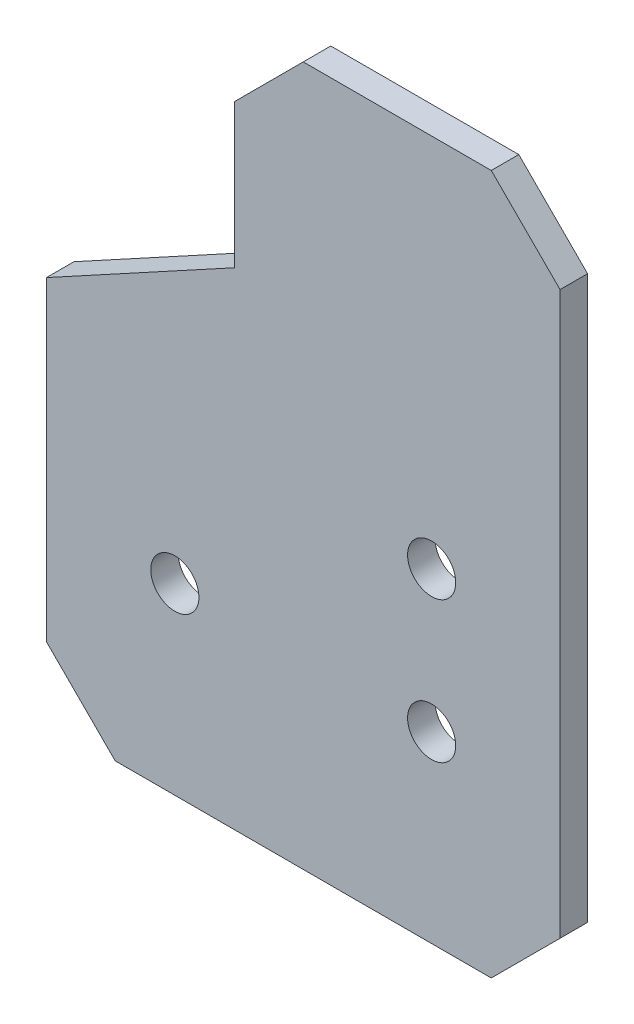
ISO-10303-21;
HEADER;
FILE_DESCRIPTION(('STEP AP214'),'2;1');
FILE_NAME('part.step','',(''),(''),'','','');
FILE_SCHEMA(('AUTOMOTIVE_DESIGN { 1 0 10303 214 1 1 1 1 }'));
ENDSEC;
DATA;
#1=APPLICATION_CONTEXT('core data for automotive mechanical design processes');
#2=APPLICATION_PROTOCOL_DEFINITION('international standard','automotive_design',2000,#1);
#3=PRODUCT_CONTEXT('',#1,'mechanical');
#4=PRODUCT('Part','Part','',(#3));
#5=PRODUCT_RELATED_PRODUCT_CATEGORY('part','',(#4));
#6=PRODUCT_DEFINITION_FORMATION('','',#4);
#7=PRODUCT_DEFINITION_CONTEXT('part definition',#1,'design');
#8=PRODUCT_DEFINITION('design','',#6,#7);
#9=PRODUCT_DEFINITION_SHAPE('','',#8);
#10=(LENGTH_UNIT() NAMED_UNIT(*) SI_UNIT(.MILLI.,.METRE.));
#11=(NAMED_UNIT(*) PLANE_ANGLE_UNIT() SI_UNIT($,.RADIAN.));
#12=(NAMED_UNIT(*) SI_UNIT($,.STERADIAN.) SOLID_ANGLE_UNIT());
#13=UNCERTAINTY_MEASURE_WITH_UNIT(LENGTH_MEASURE(1.E-05),#10,'distance_accuracy_value','');
#14=(GEOMETRIC_REPRESENTATION_CONTEXT(3) GLOBAL_UNCERTAINTY_ASSIGNED_CONTEXT((#13)) GLOBAL_UNIT_ASSIGNED_CONTEXT((#10,
#11,#12)) REPRESENTATION_CONTEXT('',''));
#15=CARTESIAN_POINT('',(0.,0.,0.));
#16=DIRECTION('',(0.,0.,1.));
#17=DIRECTION('',(1.,0.,0.));
#18=AXIS2_PLACEMENT_3D('',#15,#16,#17);
#19=CARTESIAN_POINT('',(40.9999999999999,-102.499999999992,-6.00000000000001));
#20=DIRECTION('',(0.,-1.,0.));
#21=DIRECTION('',(1.,0.,0.));
#22=AXIS2_PLACEMENT_3D('',#19,#20,#21);
#23=PLANE('',#22);
#24=DIRECTION('',(1.,0.,0.));
#25=VECTOR('',#24,1.);
#26=CARTESIAN_POINT('',(40.9999999999999,-102.499999999992,0.));
#27=LINE('',#26,#25);
#28=CARTESIAN_POINT('',(-40.9999999999991,-102.499999999992,0.));
#29=VERTEX_POINT('',#28);
#30=CARTESIAN_POINT('',(40.9999999999999,-102.499999999992,0.));
#31=VERTEX_POINT('',#30);
#32=EDGE_CURVE('E145',#29,#31,#27,.T.);
#33=ORIENTED_EDGE('',*,*,#32,.F.);
#34=DIRECTION('',(0.,0.,1.));
#35=VECTOR('',#34,1.);
#36=CARTESIAN_POINT('',(-40.9999999999991,-102.499999999992,-6.00000000000001));
#37=LINE('',#36,#35);
#38=CARTESIAN_POINT('',(-40.9999999999991,-102.499999999992,-6.00000000000001));
#39=VERTEX_POINT('',#38);
#40=EDGE_CURVE('E11',#39,#29,#37,.T.);
#41=ORIENTED_EDGE('',*,*,#40,.F.);
#42=DIRECTION('',(1.,0.,0.));
#43=VECTOR('',#42,1.);
#44=CARTESIAN_POINT('',(40.9999999999999,-102.499999999992,-6.00000000000001));
#45=LINE('',#44,#43);
#46=CARTESIAN_POINT('',(40.9999999999999,-102.499999999992,-6.00000000000001));
#47=VERTEX_POINT('',#46);
#48=EDGE_CURVE('E172',#39,#47,#45,.T.);
#49=ORIENTED_EDGE('',*,*,#48,.T.);
#50=DIRECTION('',(0.,0.,1.));
#51=VECTOR('',#50,1.);
#52=CARTESIAN_POINT('',(40.9999999999999,-102.499999999992,-6.00000000000001));
#53=LINE('',#52,#51);
#54=EDGE_CURVE('E39',#47,#31,#53,.T.);
#55=ORIENTED_EDGE('',*,*,#54,.T.);
#56=EDGE_LOOP('',(#33,#41,#49,#55));
#57=FACE_BOUND('',#56,.T.);
#58=ADVANCED_FACE('F36',(#57),#23,.T.);
#59=CARTESIAN_POINT('',(-40.9999999999991,-102.499999999992,-6.00000000000001));
#60=DIRECTION('',(-0.707106781186543,-0.707106781186552,0.));
#61=DIRECTION('',(0.707106781186552,-0.707106781186543,0.));
#62=AXIS2_PLACEMENT_3D('',#59,#60,#61);
#63=PLANE('',#62);
#64=DIRECTION('',(0.707106781186552,-0.707106781186543,0.));
#65=VECTOR('',#64,1.);
#66=CARTESIAN_POINT('',(-40.9999999999991,-102.499999999992,0.));
#67=LINE('',#66,#65);
#68=CARTESIAN_POINT('',(-55.9999999999991,-87.499999999992,0.));
#69=VERTEX_POINT('',#68);
#70=EDGE_CURVE('E170',#69,#29,#67,.T.);
#71=ORIENTED_EDGE('',*,*,#70,.F.);
#72=DIRECTION('',(0.,0.,1.));
#73=VECTOR('',#72,1.);
#74=CARTESIAN_POINT('',(-55.9999999999991,-87.499999999992,-6.00000000000001));
#75=LINE('',#74,#73);
#76=CARTESIAN_POINT('',(-55.9999999999991,-87.499999999992,-6.00000000000001));
#77=VERTEX_POINT('',#76);
#78=EDGE_CURVE('E45',#77,#69,#75,.T.);
#79=ORIENTED_EDGE('',*,*,#78,.F.);
#80=DIRECTION('',(0.707106781186552,-0.707106781186543,0.));
#81=VECTOR('',#80,1.);
#82=CARTESIAN_POINT('',(-40.9999999999991,-102.499999999992,-6.00000000000001));
#83=LINE('',#82,#81);
#84=EDGE_CURVE('E135',#77,#39,#83,.T.);
#85=ORIENTED_EDGE('',*,*,#84,.T.);
#86=ORIENTED_EDGE('',*,*,#40,.T.);
#87=EDGE_LOOP('',(#71,#79,#85,#86));
#88=FACE_BOUND('',#87,.T.);
#89=ADVANCED_FACE('F188',(#88),#63,.T.);
#90=CARTESIAN_POINT('',(-55.9999999999991,-18.731551378837,-6.00000000000001));
#91=DIRECTION('',(-1.,0.,0.));
#92=DIRECTION('',(0.,0.,1.));
#93=AXIS2_PLACEMENT_3D('',#90,#91,#92);
#94=PLANE('',#93);
#95=DIRECTION('',(0.,-1.,0.));
#96=VECTOR('',#95,1.);
#97=CARTESIAN_POINT('',(-55.9999999999991,-18.731551378837,0.));
#98=LINE('',#97,#96);
#99=CARTESIAN_POINT('',(-55.9999999999991,-18.731551378837,0.));
#100=VERTEX_POINT('',#99);
#101=EDGE_CURVE('E122',#100,#69,#98,.T.);
#102=ORIENTED_EDGE('',*,*,#101,.F.);
#103=DIRECTION('',(0.,0.,1.));
#104=VECTOR('',#103,1.);
#105=CARTESIAN_POINT('',(-55.9999999999991,-18.731551378837,-6.00000000000001));
#106=LINE('',#105,#104);
#107=CARTESIAN_POINT('',(-55.9999999999991,-18.731551378837,-6.00000000000001));
#108=VERTEX_POINT('',#107);
#109=EDGE_CURVE('E117',#108,#100,#106,.T.);
#110=ORIENTED_EDGE('',*,*,#109,.F.);
#111=DIRECTION('',(0.,-1.,0.));
#112=VECTOR('',#111,1.);
#113=CARTESIAN_POINT('',(-55.9999999999991,-18.731551378837,-6.00000000000001));
#114=LINE('',#113,#112);
#115=EDGE_CURVE('E120',#108,#77,#114,.T.);
#116=ORIENTED_EDGE('',*,*,#115,.T.);
#117=ORIENTED_EDGE('',*,*,#78,.T.);
#118=EDGE_LOOP('',(#102,#110,#116,#117));
#119=FACE_BOUND('',#118,.T.);
#120=ADVANCED_FACE('F119',(#119),#94,.T.);
#121=CARTESIAN_POINT('',(-15.,3.62230521977263,-6.00000000000001));
#122=DIRECTION('',(-0.478690717699021,0.877983597106914,0.));
#123=DIRECTION('',(-0.877983597106914,-0.478690717699021,0.));
#124=AXIS2_PLACEMENT_3D('',#121,#122,#123);
#125=PLANE('',#124);
#126=DIRECTION('',(-0.877983597106914,-0.478690717699021,0.));
#127=VECTOR('',#126,1.);
#128=CARTESIAN_POINT('',(-15.,3.62230521977263,0.));
#129=LINE('',#128,#127);
#130=CARTESIAN_POINT('',(-15.,3.62230521977263,0.));
#131=VERTEX_POINT('',#130);
#132=EDGE_CURVE('E167',#131,#100,#129,.T.);
#133=ORIENTED_EDGE('',*,*,#132,.F.);
#134=DIRECTION('',(0.,0.,1.));
#135=VECTOR('',#134,1.);
#136=CARTESIAN_POINT('',(-15.,3.62230521977263,-6.00000000000001));
#137=LINE('',#136,#135);
#138=CARTESIAN_POINT('',(-15.,3.62230521977263,-6.00000000000001));
#139=VERTEX_POINT('',#138);
#140=EDGE_CURVE('E127',#139,#131,#137,.T.);
#141=ORIENTED_EDGE('',*,*,#140,.F.);
#142=DIRECTION('',(-0.877983597106914,-0.478690717699021,0.));
#143=VECTOR('',#142,1.);
#144=CARTESIAN_POINT('',(-15.,3.62230521977263,-6.00000000000001));
#145=LINE('',#144,#143);
#146=EDGE_CURVE('E133',#139,#108,#145,.T.);
#147=ORIENTED_EDGE('',*,*,#146,.T.);
#148=ORIENTED_EDGE('',*,*,#109,.T.);
#149=EDGE_LOOP('',(#133,#141,#147,#148));
#150=FACE_BOUND('',#149,.T.);
#151=ADVANCED_FACE('F137',(#150),#125,.T.);
#152=CARTESIAN_POINT('',(-15.,34.9999999999999,-6.00000000000001));
#153=DIRECTION('',(-1.,0.,0.));
#154=DIRECTION('',(0.,0.,1.));
#155=AXIS2_PLACEMENT_3D('',#152,#153,#154);
#156=PLANE('',#155);
#157=DIRECTION('',(0.,-1.,0.));
#158=VECTOR('',#157,1.);
#159=CARTESIAN_POINT('',(-15.,34.9999999999999,0.));
#160=LINE('',#159,#158);
#161=CARTESIAN_POINT('',(-15.,34.9999999999999,0.));
#162=VERTEX_POINT('',#161);
#163=EDGE_CURVE('E164',#162,#131,#160,.T.);
#164=ORIENTED_EDGE('',*,*,#163,.F.);
#165=DIRECTION('',(0.,0.,1.));
#166=VECTOR('',#165,1.);
#167=CARTESIAN_POINT('',(-15.,34.9999999999999,-6.00000000000001));
#168=LINE('',#167,#166);
#169=CARTESIAN_POINT('',(-15.,34.9999999999999,-6.00000000000001));
#170=VERTEX_POINT('',#169);
#171=EDGE_CURVE('E176',#170,#162,#168,.T.);
#172=ORIENTED_EDGE('',*,*,#171,.F.);
#173=DIRECTION('',(0.,-1.,0.));
#174=VECTOR('',#173,1.);
#175=CARTESIAN_POINT('',(-15.,34.9999999999999,-6.00000000000001));
#176=LINE('',#175,#174);
#177=EDGE_CURVE('E138',#170,#139,#176,.T.);
#178=ORIENTED_EDGE('',*,*,#177,.T.);
#179=ORIENTED_EDGE('',*,*,#140,.T.);
#180=EDGE_LOOP('',(#164,#172,#178,#179));
#181=FACE_BOUND('',#180,.T.);
#182=ADVANCED_FACE('F201',(#181),#156,.T.);
#183=CARTESIAN_POINT('',(0.,50.,-6.00000000000001));
#184=DIRECTION('',(-0.707106781186548,0.707106781186547,0.));
#185=DIRECTION('',(-0.707106781186547,-0.707106781186548,0.));
#186=AXIS2_PLACEMENT_3D('',#183,#184,#185);
#187=PLANE('',#186);
#188=DIRECTION('',(-0.707106781186548,-0.707106781186548,0.));
#189=VECTOR('',#188,1.);
#190=CARTESIAN_POINT('',(0.,50.,0.));
#191=LINE('',#190,#189);
#192=CARTESIAN_POINT('',(0.,50.,0.));
#193=VERTEX_POINT('',#192);
#194=EDGE_CURVE('E161',#193,#162,#191,.T.);
#195=ORIENTED_EDGE('',*,*,#194,.F.);
#196=DIRECTION('',(0.,0.,1.));
#197=VECTOR('',#196,1.);
#198=CARTESIAN_POINT('',(0.,50.,-6.00000000000001));
#199=LINE('',#198,#197);
#200=CARTESIAN_POINT('',(0.,50.,-6.00000000000001));
#201=VERTEX_POINT('',#200);
#202=EDGE_CURVE('E178',#201,#193,#199,.T.);
#203=ORIENTED_EDGE('',*,*,#202,.F.);
#204=DIRECTION('',(-0.707106781186548,-0.707106781186548,0.));
#205=VECTOR('',#204,1.);
#206=CARTESIAN_POINT('',(0.,50.,-6.00000000000001));
#207=LINE('',#206,#205);
#208=EDGE_CURVE('E140',#201,#170,#207,.T.);
#209=ORIENTED_EDGE('',*,*,#208,.T.);
#210=ORIENTED_EDGE('',*,*,#171,.T.);
#211=EDGE_LOOP('',(#195,#203,#209,#210));
#212=FACE_BOUND('',#211,.T.);
#213=ADVANCED_FACE('F204',(#212),#187,.T.);
#214=CARTESIAN_POINT('',(40.9999999999996,50.,-6.00000000000001));
#215=DIRECTION('',(0.,1.,0.));
#216=DIRECTION('',(-1.,0.,0.));
#217=AXIS2_PLACEMENT_3D('',#214,#215,#216);
#218=PLANE('',#217);
#219=DIRECTION('',(-1.,0.,0.));
#220=VECTOR('',#219,1.);
#221=CARTESIAN_POINT('',(40.9999999999996,50.,0.));
#222=LINE('',#221,#220);
#223=CARTESIAN_POINT('',(40.9999999999996,50.,0.));
#224=VERTEX_POINT('',#223);
#225=EDGE_CURVE('E158',#224,#193,#222,.T.);
#226=ORIENTED_EDGE('',*,*,#225,.F.);
#227=DIRECTION('',(0.,0.,1.));
#228=VECTOR('',#227,1.);
#229=CARTESIAN_POINT('',(40.9999999999996,50.,-6.00000000000001));
#230=LINE('',#229,#228);
#231=CARTESIAN_POINT('',(40.9999999999996,50.,-6.00000000000001));
#232=VERTEX_POINT('',#231);
#233=EDGE_CURVE('E180',#232,#224,#230,.T.);
#234=ORIENTED_EDGE('',*,*,#233,.F.);
#235=DIRECTION('',(-1.,0.,0.));
#236=VECTOR('',#235,1.);
#237=CARTESIAN_POINT('',(40.9999999999996,50.,-6.00000000000001));
#238=LINE('',#237,#236);
#239=EDGE_CURVE('E274',#232,#201,#238,.T.);
#240=ORIENTED_EDGE('',*,*,#239,.T.);
#241=ORIENTED_EDGE('',*,*,#202,.T.);
#242=EDGE_LOOP('',(#226,#234,#240,#241));
#243=FACE_BOUND('',#242,.T.);
#244=ADVANCED_FACE('F208',(#243),#218,.T.);
#245=CARTESIAN_POINT('',(55.9999999999997,35.,-6.00000000000001));
#246=DIRECTION('',(0.707106781186544,0.707106781186551,0.));
#247=DIRECTION('',(-0.707106781186551,0.707106781186544,0.));
#248=AXIS2_PLACEMENT_3D('',#245,#246,#247);
#249=PLANE('',#248);
#250=DIRECTION('',(-0.707106781186551,0.707106781186544,0.));
#251=VECTOR('',#250,1.);
#252=CARTESIAN_POINT('',(55.9999999999997,35.,0.));
#253=LINE('',#252,#251);
#254=CARTESIAN_POINT('',(55.9999999999997,35.,0.));
#255=VERTEX_POINT('',#254);
#256=EDGE_CURVE('E155',#255,#224,#253,.T.);
#257=ORIENTED_EDGE('',*,*,#256,.F.);
#258=DIRECTION('',(0.,0.,1.));
#259=VECTOR('',#258,1.);
#260=CARTESIAN_POINT('',(55.9999999999997,35.,-6.00000000000001));
#261=LINE('',#260,#259);
#262=CARTESIAN_POINT('',(55.9999999999997,35.,-6.00000000000001));
#263=VERTEX_POINT('',#262);
#264=EDGE_CURVE('E182',#263,#255,#261,.T.);
#265=ORIENTED_EDGE('',*,*,#264,.F.);
#266=DIRECTION('',(-0.707106781186551,0.707106781186544,0.));
#267=VECTOR('',#266,1.);
#268=CARTESIAN_POINT('',(55.9999999999997,35.,-6.00000000000001));
#269=LINE('',#268,#267);
#270=EDGE_CURVE('E271',#263,#232,#269,.T.);
#271=ORIENTED_EDGE('',*,*,#270,.T.);
#272=ORIENTED_EDGE('',*,*,#233,.T.);
#273=EDGE_LOOP('',(#257,#265,#271,#272));
#274=FACE_BOUND('',#273,.T.);
#275=ADVANCED_FACE('F212',(#274),#249,.T.);
#276=CARTESIAN_POINT('',(55.9999999999997,-87.4999999999915,-6.00000000000001));
#277=DIRECTION('',(1.,0.,0.));
#278=DIRECTION('',(0.,1.,0.));
#279=AXIS2_PLACEMENT_3D('',#276,#277,#278);
#280=PLANE('',#279);
#281=DIRECTION('',(0.,1.,0.));
#282=VECTOR('',#281,1.);
#283=CARTESIAN_POINT('',(55.9999999999997,-87.4999999999915,0.));
#284=LINE('',#283,#282);
#285=CARTESIAN_POINT('',(55.9999999999997,-87.4999999999915,0.));
#286=VERTEX_POINT('',#285);
#287=EDGE_CURVE('E152',#286,#255,#284,.T.);
#288=ORIENTED_EDGE('',*,*,#287,.F.);
#289=DIRECTION('',(0.,0.,1.));
#290=VECTOR('',#289,1.);
#291=CARTESIAN_POINT('',(55.9999999999997,-87.4999999999915,-6.00000000000001));
#292=LINE('',#291,#290);
#293=CARTESIAN_POINT('',(55.9999999999997,-87.4999999999915,-6.00000000000001));
#294=VERTEX_POINT('',#293);
#295=EDGE_CURVE('E183',#294,#286,#292,.T.);
#296=ORIENTED_EDGE('',*,*,#295,.F.);
#297=DIRECTION('',(0.,1.,0.));
#298=VECTOR('',#297,1.);
#299=CARTESIAN_POINT('',(55.9999999999997,-87.4999999999915,-6.00000000000001));
#300=LINE('',#299,#298);
#301=EDGE_CURVE('E268',#294,#263,#300,.T.);
#302=ORIENTED_EDGE('',*,*,#301,.T.);
#303=ORIENTED_EDGE('',*,*,#264,.T.);
#304=EDGE_LOOP('',(#288,#296,#302,#303));
#305=FACE_BOUND('',#304,.T.);
#306=ADVANCED_FACE('F216',(#305),#280,.T.);
#307=CARTESIAN_POINT('',(55.9999999999997,-87.4999999999915,-6.00000000000001));
#308=DIRECTION('',(0.707106781186553,-0.707106781186542,0.));
#309=DIRECTION('',(0.707106781186542,0.707106781186553,0.));
#310=AXIS2_PLACEMENT_3D('',#307,#308,#309);
#311=PLANE('',#310);
#312=DIRECTION('',(0.707106781186542,0.707106781186553,0.));
#313=VECTOR('',#312,1.);
#314=CARTESIAN_POINT('',(55.9999999999997,-87.4999999999915,0.));
#315=LINE('',#314,#313);
#316=EDGE_CURVE('E148',#31,#286,#315,.T.);
#317=ORIENTED_EDGE('',*,*,#316,.F.);
#318=ORIENTED_EDGE('',*,*,#54,.F.);
#319=DIRECTION('',(0.707106781186542,0.707106781186553,0.));
#320=VECTOR('',#319,1.);
#321=CARTESIAN_POINT('',(55.9999999999997,-87.4999999999915,-6.00000000000001));
#322=LINE('',#321,#320);
#323=EDGE_CURVE('E266',#47,#294,#322,.T.);
#324=ORIENTED_EDGE('',*,*,#323,.T.);
#325=ORIENTED_EDGE('',*,*,#295,.T.);
#326=EDGE_LOOP('',(#317,#318,#324,#325));
#327=FACE_BOUND('',#326,.T.);
#328=ADVANCED_FACE('F185',(#327),#311,.T.);
#329=CARTESIAN_POINT('',(0.,0.,-6.00000000000001));
#330=DIRECTION('',(0.,0.,1.));
#331=DIRECTION('',(1.,0.,0.));
#332=AXIS2_PLACEMENT_3D('',#329,#330,#331);
#333=PLANE('',#332);
#334=CARTESIAN_POINT('',(27.9999999999998,-31.7261893195128,-6.00000000000001));
#335=DIRECTION('',(0.,0.,1.));
#336=DIRECTION('',(1.,0.,0.));
#337=AXIS2_PLACEMENT_3D('',#334,#335,#336);
#338=CIRCLE('',#337,5.25000000000001);
#339=CARTESIAN_POINT('',(33.2499999999998,-31.7261893195128,-6.00000000000001));
#340=VERTEX_POINT('',#339);
#341=EDGE_CURVE('E247',#340,#340,#338,.T.);
#342=ORIENTED_EDGE('',*,*,#341,.T.);
#343=EDGE_LOOP('',(#342));
#344=FACE_BOUND('',#343,.T.);
#345=CARTESIAN_POINT('',(28.,-62.4999999999919,-6.00000000000001));
#346=DIRECTION('',(0.,0.,1.));
#347=DIRECTION('',(1.,0.,0.));
#348=AXIS2_PLACEMENT_3D('',#345,#346,#347);
#349=CIRCLE('',#348,5.25);
#350=CARTESIAN_POINT('',(33.25,-62.4999999999919,-6.00000000000001));
#351=VERTEX_POINT('',#350);
#352=EDGE_CURVE('E255',#351,#351,#349,.T.);
#353=ORIENTED_EDGE('',*,*,#352,.T.);
#354=EDGE_LOOP('',(#353));
#355=FACE_BOUND('',#354,.T.);
#356=CARTESIAN_POINT('',(-27.9999999999996,-62.4999999999919,-6.00000000000001));
#357=DIRECTION('',(0.,0.,1.));
#358=DIRECTION('',(1.,0.,0.));
#359=AXIS2_PLACEMENT_3D('',#356,#357,#358);
#360=CIRCLE('',#359,5.25);
#361=CARTESIAN_POINT('',(-22.7499999999996,-62.4999999999919,-6.00000000000001));
#362=VERTEX_POINT('',#361);
#363=EDGE_CURVE('E149',#362,#362,#360,.T.);
#364=ORIENTED_EDGE('',*,*,#363,.T.);
#365=EDGE_LOOP('',(#364));
#366=FACE_BOUND('',#365,.T.);
#367=ORIENTED_EDGE('',*,*,#48,.F.);
#368=ORIENTED_EDGE('',*,*,#84,.F.);
#369=ORIENTED_EDGE('',*,*,#115,.F.);
#370=ORIENTED_EDGE('',*,*,#146,.F.);
#371=ORIENTED_EDGE('',*,*,#177,.F.);
#372=ORIENTED_EDGE('',*,*,#208,.F.);
#373=ORIENTED_EDGE('',*,*,#239,.F.);
#374=ORIENTED_EDGE('',*,*,#270,.F.);
#375=ORIENTED_EDGE('',*,*,#301,.F.);
#376=ORIENTED_EDGE('',*,*,#323,.F.);
#377=EDGE_LOOP('',(#367,#368,#369,#370,#371,#372,#373,#374,#375,#376));
#378=FACE_BOUND('',#377,.T.);
#379=ADVANCED_FACE('F131',(#344,#355,#366,#378),#333,.F.);
#380=CARTESIAN_POINT('',(0.,0.,0.));
#381=DIRECTION('',(0.,0.,1.));
#382=DIRECTION('',(1.,0.,0.));
#383=AXIS2_PLACEMENT_3D('',#380,#381,#382);
#384=PLANE('',#383);
#385=CARTESIAN_POINT('',(27.9999999999998,-31.7261893195128,0.));
#386=DIRECTION('',(0.,0.,1.));
#387=DIRECTION('',(1.,0.,0.));
#388=AXIS2_PLACEMENT_3D('',#385,#386,#387);
#389=CIRCLE('',#388,5.25000000000001);
#390=CARTESIAN_POINT('',(33.2499999999998,-31.7261893195128,0.));
#391=VERTEX_POINT('',#390);
#392=EDGE_CURVE('E250',#391,#391,#389,.T.);
#393=ORIENTED_EDGE('',*,*,#392,.F.);
#394=EDGE_LOOP('',(#393));
#395=FACE_BOUND('',#394,.T.);
#396=CARTESIAN_POINT('',(28.,-62.4999999999919,0.));
#397=DIRECTION('',(0.,0.,1.));
#398=DIRECTION('',(1.,0.,0.));
#399=AXIS2_PLACEMENT_3D('',#396,#397,#398);
#400=CIRCLE('',#399,5.25);
#401=CARTESIAN_POINT('',(33.25,-62.4999999999919,0.));
#402=VERTEX_POINT('',#401);
#403=EDGE_CURVE('E252',#402,#402,#400,.T.);
#404=ORIENTED_EDGE('',*,*,#403,.F.);
#405=EDGE_LOOP('',(#404));
#406=FACE_BOUND('',#405,.T.);
#407=CARTESIAN_POINT('',(-27.9999999999996,-62.4999999999919,0.));
#408=DIRECTION('',(0.,0.,1.));
#409=DIRECTION('',(1.,0.,0.));
#410=AXIS2_PLACEMENT_3D('',#407,#408,#409);
#411=CIRCLE('',#410,5.25);
#412=CARTESIAN_POINT('',(-22.7499999999996,-62.4999999999919,0.));
#413=VERTEX_POINT('',#412);
#414=EDGE_CURVE('E258',#413,#413,#411,.T.);
#415=ORIENTED_EDGE('',*,*,#414,.F.);
#416=EDGE_LOOP('',(#415));
#417=FACE_BOUND('',#416,.T.);
#418=ORIENTED_EDGE('',*,*,#32,.T.);
#419=ORIENTED_EDGE('',*,*,#316,.T.);
#420=ORIENTED_EDGE('',*,*,#287,.T.);
#421=ORIENTED_EDGE('',*,*,#256,.T.);
#422=ORIENTED_EDGE('',*,*,#225,.T.);
#423=ORIENTED_EDGE('',*,*,#194,.T.);
#424=ORIENTED_EDGE('',*,*,#163,.T.);
#425=ORIENTED_EDGE('',*,*,#132,.T.);
#426=ORIENTED_EDGE('',*,*,#101,.T.);
#427=ORIENTED_EDGE('',*,*,#70,.T.);
#428=EDGE_LOOP('',(#418,#419,#420,#421,#422,#423,#424,#425,#426,#427));
#429=FACE_BOUND('',#428,.T.);
#430=ADVANCED_FACE('F187',(#395,#406,#417,#429),#384,.T.);
#431=CARTESIAN_POINT('',(-27.9999999999996,-62.4999999999919,-6.00000000000001));
#432=DIRECTION('',(0.,0.,1.));
#433=DIRECTION('',(1.,0.,0.));
#434=AXIS2_PLACEMENT_3D('',#431,#432,#433);
#435=CYLINDRICAL_SURFACE('',#434,5.25);
#436=ORIENTED_EDGE('',*,*,#363,.F.);
#437=EDGE_LOOP('',(#436));
#438=FACE_BOUND('',#437,.T.);
#439=ORIENTED_EDGE('',*,*,#414,.T.);
#440=EDGE_LOOP('',(#439));
#441=FACE_BOUND('',#440,.T.);
#442=ADVANCED_FACE('F228',(#438,#441),#435,.F.);
#443=CARTESIAN_POINT('',(28.,-62.4999999999919,-6.00000000000001));
#444=DIRECTION('',(0.,0.,1.));
#445=DIRECTION('',(1.,0.,0.));
#446=AXIS2_PLACEMENT_3D('',#443,#444,#445);
#447=CYLINDRICAL_SURFACE('',#446,5.25);
#448=ORIENTED_EDGE('',*,*,#352,.F.);
#449=EDGE_LOOP('',(#448));
#450=FACE_BOUND('',#449,.T.);
#451=ORIENTED_EDGE('',*,*,#403,.T.);
#452=EDGE_LOOP('',(#451));
#453=FACE_BOUND('',#452,.T.);
#454=ADVANCED_FACE('F235',(#450,#453),#447,.F.);
#455=CARTESIAN_POINT('',(27.9999999999998,-31.7261893195128,-6.00000000000001));
#456=DIRECTION('',(0.,0.,1.));
#457=DIRECTION('',(1.,0.,0.));
#458=AXIS2_PLACEMENT_3D('',#455,#456,#457);
#459=CYLINDRICAL_SURFACE('',#458,5.25000000000001);
#460=ORIENTED_EDGE('',*,*,#341,.F.);
#461=EDGE_LOOP('',(#460));
#462=FACE_BOUND('',#461,.T.);
#463=ORIENTED_EDGE('',*,*,#392,.T.);
#464=EDGE_LOOP('',(#463));
#465=FACE_BOUND('',#464,.T.);
#466=ADVANCED_FACE('F239',(#462,#465),#459,.F.);
#467=CLOSED_SHELL('',(#58,#89,#120,#151,#182,#213,#244,#275,#306,#328,#379,#430,#442,#454,#466));
#468=MANIFOLD_SOLID_BREP('B2',#467);
#469=ADVANCED_BREP_SHAPE_REPRESENTATION('',(#18,#468),#14);
#470=SHAPE_DEFINITION_REPRESENTATION(#9,#469);
ENDSEC;
END-ISO-10303-21;
